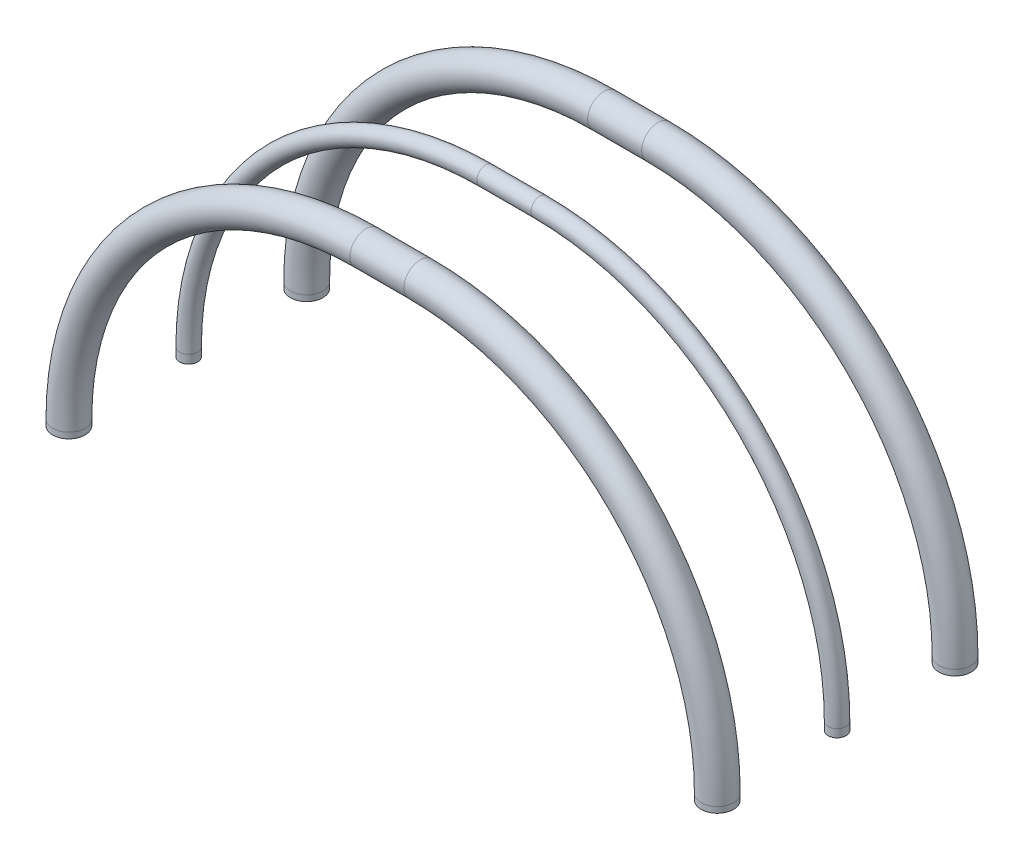
ISO-10303-21;
HEADER;
FILE_DESCRIPTION(('STEP AP214'),'2;1');
FILE_NAME('part.step','',(''),(''),'','','');
FILE_SCHEMA(('AUTOMOTIVE_DESIGN { 1 0 10303 214 1 1 1 1 }'));
ENDSEC;
DATA;
#1=APPLICATION_CONTEXT('core data for automotive mechanical design processes');
#2=APPLICATION_PROTOCOL_DEFINITION('international standard','automotive_design',2000,#1);
#3=PRODUCT_CONTEXT('',#1,'mechanical');
#4=PRODUCT('Part','Part','',(#3));
#5=PRODUCT_RELATED_PRODUCT_CATEGORY('part','',(#4));
#6=PRODUCT_DEFINITION_FORMATION('','',#4);
#7=PRODUCT_DEFINITION_CONTEXT('part definition',#1,'design');
#8=PRODUCT_DEFINITION('design','',#6,#7);
#9=PRODUCT_DEFINITION_SHAPE('','',#8);
#10=(LENGTH_UNIT() NAMED_UNIT(*) SI_UNIT(.MILLI.,.METRE.));
#11=(NAMED_UNIT(*) PLANE_ANGLE_UNIT() SI_UNIT($,.RADIAN.));
#12=(NAMED_UNIT(*) SI_UNIT($,.STERADIAN.) SOLID_ANGLE_UNIT());
#13=UNCERTAINTY_MEASURE_WITH_UNIT(LENGTH_MEASURE(1.E-05),#10,'distance_accuracy_value','');
#14=(GEOMETRIC_REPRESENTATION_CONTEXT(3) GLOBAL_UNCERTAINTY_ASSIGNED_CONTEXT((#13)) GLOBAL_UNIT_ASSIGNED_CONTEXT((#10,
#11,#12)) REPRESENTATION_CONTEXT('',''));
#15=CARTESIAN_POINT('',(0.,0.,0.));
#16=DIRECTION('',(0.,0.,1.));
#17=DIRECTION('',(1.,0.,0.));
#18=AXIS2_PLACEMENT_3D('',#15,#16,#17);
#19=CARTESIAN_POINT('',(-21649.9813405343,11704.6063194342,40541.3784980753));
#20=DIRECTION('',(0.,1.,0.));
#21=DIRECTION('',(0.,0.,1.));
#22=AXIS2_PLACEMENT_3D('',#19,#20,#21);
#23=PLANE('',#22);
#24=CARTESIAN_POINT('',(-21649.9813405343,11704.6063194342,40541.3784980753));
#25=DIRECTION('',(0.,1.,0.));
#26=DIRECTION('',(0.,0.,1.));
#27=AXIS2_PLACEMENT_3D('',#24,#25,#26);
#28=CIRCLE('',#27,15.7000000000002);
#29=CARTESIAN_POINT('',(-21649.9813405343,11704.6063194342,40557.0784980753));
#30=VERTEX_POINT('',#29);
#31=EDGE_CURVE('E97',#30,#30,#28,.T.);
#32=ORIENTED_EDGE('',*,*,#31,.T.);
#33=EDGE_LOOP('',(#32));
#34=FACE_BOUND('',#33,.T.);
#35=CARTESIAN_POINT('',(-21649.9813405343,11704.6063194342,40541.3784980753));
#36=DIRECTION('',(0.,1.,0.));
#37=DIRECTION('',(0.,0.,1.));
#38=AXIS2_PLACEMENT_3D('',#35,#36,#37);
#39=CIRCLE('',#38,16.7000000000002);
#40=CARTESIAN_POINT('',(-21649.9813405343,11704.6063194342,40558.0784980753));
#41=VERTEX_POINT('',#40);
#42=EDGE_CURVE('E90',#41,#41,#39,.T.);
#43=ORIENTED_EDGE('',*,*,#42,.F.);
#44=EDGE_LOOP('',(#43));
#45=FACE_BOUND('',#44,.T.);
#46=ADVANCED_FACE('F68',(#34,#45),#23,.F.);
#47=CARTESIAN_POINT('',(-22849.9813405343,11703.5487893793,40541.3784980753));
#48=DIRECTION('',(0.,-1.,0.));
#49=DIRECTION('',(0.,0.,1.));
#50=AXIS2_PLACEMENT_3D('',#47,#48,#49);
#51=PLANE('',#50);
#52=CARTESIAN_POINT('',(-22849.9813405343,11703.5487893793,40541.3784980753));
#53=DIRECTION('',(0.,-1.,0.));
#54=DIRECTION('',(0.,0.,-1.));
#55=AXIS2_PLACEMENT_3D('',#52,#53,#54);
#56=CIRCLE('',#55,15.7000000000002);
#57=CARTESIAN_POINT('',(-22849.9813405343,11703.5487893793,40525.6784980753));
#58=VERTEX_POINT('',#57);
#59=EDGE_CURVE('E93',#58,#58,#56,.T.);
#60=ORIENTED_EDGE('',*,*,#59,.F.);
#61=EDGE_LOOP('',(#60));
#62=FACE_BOUND('',#61,.T.);
#63=CARTESIAN_POINT('',(-22849.9813405343,11703.5487893793,40541.3784980753));
#64=DIRECTION('',(0.,-1.,0.));
#65=DIRECTION('',(0.,0.,1.));
#66=AXIS2_PLACEMENT_3D('',#63,#64,#65);
#67=CIRCLE('',#66,16.7000000000002);
#68=CARTESIAN_POINT('',(-22849.9813405343,11703.5487893793,40558.0784980753));
#69=VERTEX_POINT('',#68);
#70=EDGE_CURVE('E12',#69,#69,#67,.T.);
#71=ORIENTED_EDGE('',*,*,#70,.T.);
#72=EDGE_LOOP('',(#71));
#73=FACE_BOUND('',#72,.T.);
#74=ADVANCED_FACE('F140',(#62,#73),#51,.T.);
#75=CARTESIAN_POINT('',(-21649.9813405343,11704.6063194342,40541.3784980753));
#76=DIRECTION('',(0.,1.,0.));
#77=DIRECTION('',(0.,0.,1.));
#78=AXIS2_PLACEMENT_3D('',#75,#76,#77);
#79=CYLINDRICAL_SURFACE('',#78,16.7000000000002);
#80=CARTESIAN_POINT('',(-21649.9813405343,11719.3941812898,40541.3784980753));
#81=DIRECTION('',(0.,1.,0.));
#82=DIRECTION('',(0.,0.,1.));
#83=AXIS2_PLACEMENT_3D('',#80,#81,#82);
#84=CIRCLE('',#83,16.7000000000002);
#85=CARTESIAN_POINT('',(-21633.2813405342,11719.3941812898,40541.3784980753));
#86=VERTEX_POINT('',#85);
#87=EDGE_CURVE('E87',#86,#86,#84,.T.);
#88=ORIENTED_EDGE('',*,*,#87,.F.);
#89=EDGE_LOOP('',(#88));
#90=FACE_BOUND('',#89,.T.);
#91=ORIENTED_EDGE('',*,*,#42,.T.);
#92=EDGE_LOOP('',(#91));
#93=FACE_BOUND('',#92,.T.);
#94=ADVANCED_FACE('F142',(#90,#93),#79,.T.);
#95=CARTESIAN_POINT('',(-22199.9813405343,11719.3941812898,40541.3784980753));
#96=DIRECTION('',(0.,0.,1.));
#97=DIRECTION('',(1.,0.,0.));
#98=AXIS2_PLACEMENT_3D('',#95,#96,#97);
#99=TOROIDAL_SURFACE('',#98,550.00000000004,16.7000000000002);
#100=CARTESIAN_POINT('',(-22199.9813405343,12269.3941812898,40541.3784980753));
#101=DIRECTION('',(-1.,0.,0.));
#102=DIRECTION('',(0.,0.,1.));
#103=AXIS2_PLACEMENT_3D('',#100,#101,#102);
#104=CIRCLE('',#103,16.7000000000002);
#105=CARTESIAN_POINT('',(-22199.9813405343,12286.0941812898,40541.3784980753));
#106=VERTEX_POINT('',#105);
#107=EDGE_CURVE('E82',#106,#106,#104,.T.);
#108=CARTESIAN_POINT('',(-22199.9813405343,11719.3941812898,40541.3784980753));
#109=DIRECTION('',(0.,0.,1.));
#110=DIRECTION('',(1.,0.,0.));
#111=AXIS2_PLACEMENT_3D('',#108,#109,#110);
#112=CIRCLE('',#111,566.70000000004);
#113=EDGE_CURVE('',#86,#106,#112,.T.);
#114=ORIENTED_EDGE('',*,*,#87,.T.);
#115=ORIENTED_EDGE('',*,*,#107,.F.);
#116=ORIENTED_EDGE('',*,*,#113,.T.);
#117=ORIENTED_EDGE('',*,*,#113,.F.);
#118=EDGE_LOOP('',(#114,#116,#115,#117));
#119=FACE_BOUND('',#118,.T.);
#120=ADVANCED_FACE('F148',(#119),#99,.T.);
#121=CARTESIAN_POINT('',(-22199.9813405343,12269.3941812898,40541.3784980753));
#122=DIRECTION('',(-1.,0.,0.));
#123=DIRECTION('',(0.,0.,1.));
#124=AXIS2_PLACEMENT_3D('',#121,#122,#123);
#125=CYLINDRICAL_SURFACE('',#124,16.7000000000002);
#126=CARTESIAN_POINT('',(-22299.9813405343,12269.3941812898,40541.3784980753));
#127=DIRECTION('',(-1.,0.,0.));
#128=DIRECTION('',(0.,0.,1.));
#129=AXIS2_PLACEMENT_3D('',#126,#127,#128);
#130=CIRCLE('',#129,16.7000000000002);
#131=CARTESIAN_POINT('',(-22299.9813405343,12286.0941812898,40541.3784980753));
#132=VERTEX_POINT('',#131);
#133=EDGE_CURVE('E78',#132,#132,#130,.T.);
#134=ORIENTED_EDGE('',*,*,#133,.F.);
#135=EDGE_LOOP('',(#134));
#136=FACE_BOUND('',#135,.T.);
#137=ORIENTED_EDGE('',*,*,#107,.T.);
#138=EDGE_LOOP('',(#137));
#139=FACE_BOUND('',#138,.T.);
#140=ADVANCED_FACE('F136',(#136,#139),#125,.T.);
#141=CARTESIAN_POINT('',(-22299.9813405343,11719.3941812898,40541.3784980753));
#142=DIRECTION('',(0.,0.,1.));
#143=DIRECTION('',(1.,0.,0.));
#144=AXIS2_PLACEMENT_3D('',#141,#142,#143);
#145=TOROIDAL_SURFACE('',#144,549.999999999997,16.7000000000002);
#146=CARTESIAN_POINT('',(-22849.9813405343,11719.3941812898,40541.3784980753));
#147=DIRECTION('',(0.,-1.,0.));
#148=DIRECTION('',(0.,0.,1.));
#149=AXIS2_PLACEMENT_3D('',#146,#147,#148);
#150=CIRCLE('',#149,16.7000000000002);
#151=CARTESIAN_POINT('',(-22866.6813405343,11719.3941812898,40541.3784980753));
#152=VERTEX_POINT('',#151);
#153=EDGE_CURVE('E74',#152,#152,#150,.T.);
#154=CARTESIAN_POINT('',(-22299.9813405343,11719.3941812898,40541.3784980753));
#155=DIRECTION('',(0.,0.,1.));
#156=DIRECTION('',(1.,0.,0.));
#157=AXIS2_PLACEMENT_3D('',#154,#155,#156);
#158=CIRCLE('',#157,566.699999999997);
#159=EDGE_CURVE('',#132,#152,#158,.T.);
#160=ORIENTED_EDGE('',*,*,#133,.T.);
#161=ORIENTED_EDGE('',*,*,#153,.F.);
#162=ORIENTED_EDGE('',*,*,#159,.T.);
#163=ORIENTED_EDGE('',*,*,#159,.F.);
#164=EDGE_LOOP('',(#160,#162,#161,#163));
#165=FACE_BOUND('',#164,.T.);
#166=ADVANCED_FACE('F130',(#165),#145,.T.);
#167=CARTESIAN_POINT('',(-22849.9813405343,11719.3941812898,40541.3784980753));
#168=DIRECTION('',(0.,-1.,0.));
#169=DIRECTION('',(0.,0.,-1.));
#170=AXIS2_PLACEMENT_3D('',#167,#168,#169);
#171=CYLINDRICAL_SURFACE('',#170,16.7000000000002);
#172=ORIENTED_EDGE('',*,*,#70,.F.);
#173=EDGE_LOOP('',(#172));
#174=FACE_BOUND('',#173,.T.);
#175=ORIENTED_EDGE('',*,*,#153,.T.);
#176=EDGE_LOOP('',(#175));
#177=FACE_BOUND('',#176,.T.);
#178=ADVANCED_FACE('F127',(#174,#177),#171,.T.);
#179=CARTESIAN_POINT('',(-21649.9813405343,11704.6063194342,40541.3784980753));
#180=DIRECTION('',(0.,1.,0.));
#181=DIRECTION('',(0.,0.,1.));
#182=AXIS2_PLACEMENT_3D('',#179,#180,#181);
#183=CYLINDRICAL_SURFACE('',#182,15.7000000000002);
#184=CARTESIAN_POINT('',(-21649.9813405342,11719.3941812898,40541.3784980753));
#185=DIRECTION('',(0.,-1.,0.));
#186=DIRECTION('',(1.,0.,0.));
#187=AXIS2_PLACEMENT_3D('',#184,#185,#186);
#188=CIRCLE('',#187,15.7000000000002);
#189=CARTESIAN_POINT('',(-21634.2813405342,11719.3941812898,40541.3784980753));
#190=VERTEX_POINT('',#189);
#191=EDGE_CURVE('E100',#190,#190,#188,.F.);
#192=ORIENTED_EDGE('',*,*,#191,.T.);
#193=EDGE_LOOP('',(#192));
#194=FACE_BOUND('',#193,.T.);
#195=ORIENTED_EDGE('',*,*,#31,.F.);
#196=EDGE_LOOP('',(#195));
#197=FACE_BOUND('',#196,.T.);
#198=ADVANCED_FACE('F112',(#194,#197),#183,.F.);
#199=CARTESIAN_POINT('',(-22199.9813405343,11719.3941812898,40541.3784980753));
#200=DIRECTION('',(0.,0.,1.));
#201=DIRECTION('',(1.,0.,0.));
#202=AXIS2_PLACEMENT_3D('',#199,#200,#201);
#203=TOROIDAL_SURFACE('',#202,550.00000000004,15.7000000000002);
#204=CARTESIAN_POINT('',(-22199.9813405343,12269.3941812898,40541.3784980753));
#205=DIRECTION('',(-1.,0.,0.));
#206=DIRECTION('',(0.,0.,1.));
#207=AXIS2_PLACEMENT_3D('',#204,#205,#206);
#208=CIRCLE('',#207,15.7000000000002);
#209=CARTESIAN_POINT('',(-22199.9813405343,12285.0941812898,40541.3784980753));
#210=VERTEX_POINT('',#209);
#211=EDGE_CURVE('E106',#210,#210,#208,.T.);
#212=CARTESIAN_POINT('',(-22199.9813405343,11719.3941812898,40541.3784980753));
#213=DIRECTION('',(0.,0.,1.));
#214=DIRECTION('',(1.,0.,0.));
#215=AXIS2_PLACEMENT_3D('',#212,#213,#214);
#216=CIRCLE('',#215,565.70000000004);
#217=EDGE_CURVE('',#190,#210,#216,.T.);
#218=ORIENTED_EDGE('',*,*,#191,.F.);
#219=ORIENTED_EDGE('',*,*,#211,.T.);
#220=ORIENTED_EDGE('',*,*,#217,.T.);
#221=ORIENTED_EDGE('',*,*,#217,.F.);
#222=EDGE_LOOP('',(#218,#220,#219,#221));
#223=FACE_BOUND('',#222,.T.);
#224=ADVANCED_FACE('F115',(#223),#203,.F.);
#225=CARTESIAN_POINT('',(-22199.9813405343,12269.3941812898,40541.3784980753));
#226=DIRECTION('',(-1.,0.,0.));
#227=DIRECTION('',(0.,0.,1.));
#228=AXIS2_PLACEMENT_3D('',#225,#226,#227);
#229=CYLINDRICAL_SURFACE('',#228,15.7000000000002);
#230=CARTESIAN_POINT('',(-22299.9813405343,12269.3941812898,40541.3784980753));
#231=DIRECTION('',(1.,0.,0.));
#232=DIRECTION('',(0.,1.,0.));
#233=AXIS2_PLACEMENT_3D('',#230,#231,#232);
#234=CIRCLE('',#233,15.7000000000002);
#235=CARTESIAN_POINT('',(-22299.9813405343,12285.0941812898,40541.3784980753));
#236=VERTEX_POINT('',#235);
#237=EDGE_CURVE('E103',#236,#236,#234,.F.);
#238=ORIENTED_EDGE('',*,*,#237,.T.);
#239=EDGE_LOOP('',(#238));
#240=FACE_BOUND('',#239,.T.);
#241=ORIENTED_EDGE('',*,*,#211,.F.);
#242=EDGE_LOOP('',(#241));
#243=FACE_BOUND('',#242,.T.);
#244=ADVANCED_FACE('F117',(#240,#243),#229,.F.);
#245=CARTESIAN_POINT('',(-22299.9813405343,11719.3941812898,40541.3784980753));
#246=DIRECTION('',(0.,0.,1.));
#247=DIRECTION('',(1.,0.,0.));
#248=AXIS2_PLACEMENT_3D('',#245,#246,#247);
#249=TOROIDAL_SURFACE('',#248,549.999999999997,15.7000000000002);
#250=CARTESIAN_POINT('',(-22849.9813405343,11719.3941812898,40541.3784980753));
#251=DIRECTION('',(0.,-1.,0.));
#252=DIRECTION('',(0.,0.,-1.));
#253=AXIS2_PLACEMENT_3D('',#250,#251,#252);
#254=CIRCLE('',#253,15.7000000000002);
#255=CARTESIAN_POINT('',(-22865.6813405342,11719.3941812898,40541.3784980753));
#256=VERTEX_POINT('',#255);
#257=EDGE_CURVE('E96',#256,#256,#254,.T.);
#258=CARTESIAN_POINT('',(-22299.9813405343,11719.3941812898,40541.3784980753));
#259=DIRECTION('',(0.,0.,1.));
#260=DIRECTION('',(1.,0.,0.));
#261=AXIS2_PLACEMENT_3D('',#258,#259,#260);
#262=CIRCLE('',#261,565.699999999997);
#263=EDGE_CURVE('',#236,#256,#262,.T.);
#264=ORIENTED_EDGE('',*,*,#237,.F.);
#265=ORIENTED_EDGE('',*,*,#257,.T.);
#266=ORIENTED_EDGE('',*,*,#263,.T.);
#267=ORIENTED_EDGE('',*,*,#263,.F.);
#268=EDGE_LOOP('',(#264,#266,#265,#267));
#269=FACE_BOUND('',#268,.T.);
#270=ADVANCED_FACE('F124',(#269),#249,.F.);
#271=CARTESIAN_POINT('',(-22849.9813405343,11719.3941812898,40541.3784980753));
#272=DIRECTION('',(0.,-1.,0.));
#273=DIRECTION('',(0.,0.,-1.));
#274=AXIS2_PLACEMENT_3D('',#271,#272,#273);
#275=CYLINDRICAL_SURFACE('',#274,15.7000000000002);
#276=ORIENTED_EDGE('',*,*,#59,.T.);
#277=EDGE_LOOP('',(#276));
#278=FACE_BOUND('',#277,.T.);
#279=ORIENTED_EDGE('',*,*,#257,.F.);
#280=EDGE_LOOP('',(#279));
#281=FACE_BOUND('',#280,.T.);
#282=ADVANCED_FACE('F152',(#278,#281),#275,.F.);
#283=CLOSED_SHELL('',(#46,#74,#94,#120,#140,#166,#178,#198,#224,#244,#270,#282));
#284=MANIFOLD_SOLID_BREP('B2',#283);
#285=CARTESIAN_POINT('',(-22850.481156353,11703.4506207878,40322.4958478472));
#286=DIRECTION('',(0.,1.,0.));
#287=DIRECTION('',(0.,0.,1.));
#288=AXIS2_PLACEMENT_3D('',#285,#286,#287);
#289=PLANE('',#288);
#290=CARTESIAN_POINT('',(-22850.481156353,11703.4506207878,40322.4958478472));
#291=DIRECTION('',(0.,1.,0.));
#292=DIRECTION('',(0.,0.,1.));
#293=AXIS2_PLACEMENT_3D('',#290,#291,#292);
#294=CIRCLE('',#293,29.0000000000011);
#295=CARTESIAN_POINT('',(-22850.481156353,11703.4506207878,40351.4958478472));
#296=VERTEX_POINT('',#295);
#297=EDGE_CURVE('E310',#296,#296,#294,.T.);
#298=ORIENTED_EDGE('',*,*,#297,.T.);
#299=EDGE_LOOP('',(#298));
#300=FACE_BOUND('',#299,.T.);
#301=CARTESIAN_POINT('',(-22850.481156353,11703.4506207878,40322.4958478472));
#302=DIRECTION('',(0.,1.,0.));
#303=DIRECTION('',(0.,0.,1.));
#304=AXIS2_PLACEMENT_3D('',#301,#302,#303);
#305=CIRCLE('',#304,30.0000000000011);
#306=CARTESIAN_POINT('',(-22850.481156353,11703.4506207878,40352.4958478472));
#307=VERTEX_POINT('',#306);
#308=EDGE_CURVE('E303',#307,#307,#305,.T.);
#309=ORIENTED_EDGE('',*,*,#308,.F.);
#310=EDGE_LOOP('',(#309));
#311=FACE_BOUND('',#310,.T.);
#312=ADVANCED_FACE('F281',(#300,#311),#289,.F.);
#313=CARTESIAN_POINT('',(-21650.481156353,11703.4506207878,40322.4958478472));
#314=DIRECTION('',(0.,-1.,0.));
#315=DIRECTION('',(0.,0.,1.));
#316=AXIS2_PLACEMENT_3D('',#313,#314,#315);
#317=PLANE('',#316);
#318=CARTESIAN_POINT('',(-21650.481156353,11703.4506207878,40322.4958478472));
#319=DIRECTION('',(0.,-1.,0.));
#320=DIRECTION('',(0.,0.,-1.));
#321=AXIS2_PLACEMENT_3D('',#318,#319,#320);
#322=CIRCLE('',#321,29.0000000000011);
#323=CARTESIAN_POINT('',(-21650.481156353,11703.4506207878,40293.4958478472));
#324=VERTEX_POINT('',#323);
#325=EDGE_CURVE('E306',#324,#324,#322,.T.);
#326=ORIENTED_EDGE('',*,*,#325,.F.);
#327=EDGE_LOOP('',(#326));
#328=FACE_BOUND('',#327,.T.);
#329=CARTESIAN_POINT('',(-21650.481156353,11703.4506207878,40322.4958478472));
#330=DIRECTION('',(0.,-1.,0.));
#331=DIRECTION('',(0.,0.,1.));
#332=AXIS2_PLACEMENT_3D('',#329,#330,#331);
#333=CIRCLE('',#332,30.0000000000011);
#334=CARTESIAN_POINT('',(-21650.481156353,11703.4506207878,40352.4958478472));
#335=VERTEX_POINT('',#334);
#336=EDGE_CURVE('E67',#335,#335,#333,.T.);
#337=ORIENTED_EDGE('',*,*,#336,.T.);
#338=EDGE_LOOP('',(#337));
#339=FACE_BOUND('',#338,.T.);
#340=ADVANCED_FACE('F353',(#328,#339),#317,.T.);
#341=CARTESIAN_POINT('',(-22850.481156353,11703.4506207878,40322.4958478472));
#342=DIRECTION('',(0.,1.,0.));
#343=DIRECTION('',(0.,0.,1.));
#344=AXIS2_PLACEMENT_3D('',#341,#342,#343);
#345=CYLINDRICAL_SURFACE('',#344,30.0000000000011);
#346=CARTESIAN_POINT('',(-22850.481156353,11714.2234820204,40322.4958478472));
#347=DIRECTION('',(0.,1.,0.));
#348=DIRECTION('',(0.,0.,1.));
#349=AXIS2_PLACEMENT_3D('',#346,#347,#348);
#350=CIRCLE('',#349,30.0000000000011);
#351=CARTESIAN_POINT('',(-22880.481156353,11714.2234820204,40322.4958478472));
#352=VERTEX_POINT('',#351);
#353=EDGE_CURVE('E300',#352,#352,#350,.T.);
#354=ORIENTED_EDGE('',*,*,#353,.F.);
#355=EDGE_LOOP('',(#354));
#356=FACE_BOUND('',#355,.T.);
#357=ORIENTED_EDGE('',*,*,#308,.T.);
#358=EDGE_LOOP('',(#357));
#359=FACE_BOUND('',#358,.T.);
#360=ADVANCED_FACE('F355',(#356,#359),#345,.T.);
#361=CARTESIAN_POINT('',(-22300.481156353,11714.2234820204,40322.4958478472));
#362=DIRECTION('',(0.,0.,-1.));
#363=DIRECTION('',(-1.,0.,0.));
#364=AXIS2_PLACEMENT_3D('',#361,#362,#363);
#365=TOROIDAL_SURFACE('',#364,550.00000000004,30.0000000000011);
#366=CARTESIAN_POINT('',(-22300.481156353,12264.2234820204,40322.4958478472));
#367=DIRECTION('',(1.,0.,0.));
#368=DIRECTION('',(0.,0.,1.));
#369=AXIS2_PLACEMENT_3D('',#366,#367,#368);
#370=CIRCLE('',#369,30.0000000000011);
#371=CARTESIAN_POINT('',(-22300.481156353,12294.2234820204,40322.4958478472));
#372=VERTEX_POINT('',#371);
#373=EDGE_CURVE('E295',#372,#372,#370,.T.);
#374=CARTESIAN_POINT('',(-22300.481156353,11714.2234820204,40322.4958478472));
#375=DIRECTION('',(0.,0.,-1.));
#376=DIRECTION('',(-1.,0.,0.));
#377=AXIS2_PLACEMENT_3D('',#374,#375,#376);
#378=CIRCLE('',#377,580.000000000041);
#379=EDGE_CURVE('',#352,#372,#378,.T.);
#380=ORIENTED_EDGE('',*,*,#353,.T.);
#381=ORIENTED_EDGE('',*,*,#373,.F.);
#382=ORIENTED_EDGE('',*,*,#379,.T.);
#383=ORIENTED_EDGE('',*,*,#379,.F.);
#384=EDGE_LOOP('',(#380,#382,#381,#383));
#385=FACE_BOUND('',#384,.T.);
#386=ADVANCED_FACE('F361',(#385),#365,.T.);
#387=CARTESIAN_POINT('',(-22300.481156353,12264.2234820204,40322.4958478472));
#388=DIRECTION('',(1.,0.,0.));
#389=DIRECTION('',(0.,0.,-1.));
#390=AXIS2_PLACEMENT_3D('',#387,#388,#389);
#391=CYLINDRICAL_SURFACE('',#390,30.0000000000011);
#392=CARTESIAN_POINT('',(-22200.481156353,12264.2234820204,40322.4958478472));
#393=DIRECTION('',(1.,0.,0.));
#394=DIRECTION('',(0.,0.,1.));
#395=AXIS2_PLACEMENT_3D('',#392,#393,#394);
#396=CIRCLE('',#395,30.0000000000011);
#397=CARTESIAN_POINT('',(-22200.481156353,12294.2234820204,40322.4958478472));
#398=VERTEX_POINT('',#397);
#399=EDGE_CURVE('E291',#398,#398,#396,.T.);
#400=ORIENTED_EDGE('',*,*,#399,.F.);
#401=EDGE_LOOP('',(#400));
#402=FACE_BOUND('',#401,.T.);
#403=ORIENTED_EDGE('',*,*,#373,.T.);
#404=EDGE_LOOP('',(#403));
#405=FACE_BOUND('',#404,.T.);
#406=ADVANCED_FACE('F349',(#402,#405),#391,.T.);
#407=CARTESIAN_POINT('',(-22200.481156353,11714.2234820204,40322.4958478472));
#408=DIRECTION('',(0.,0.,-1.));
#409=DIRECTION('',(-1.,0.,0.));
#410=AXIS2_PLACEMENT_3D('',#407,#408,#409);
#411=TOROIDAL_SURFACE('',#410,550.000000000001,30.0000000000011);
#412=CARTESIAN_POINT('',(-21650.481156353,11714.2234820204,40322.4958478472));
#413=DIRECTION('',(0.,-1.,0.));
#414=DIRECTION('',(0.,0.,1.));
#415=AXIS2_PLACEMENT_3D('',#412,#413,#414);
#416=CIRCLE('',#415,30.0000000000011);
#417=CARTESIAN_POINT('',(-21620.481156353,11714.2234820204,40322.4958478472));
#418=VERTEX_POINT('',#417);
#419=EDGE_CURVE('E287',#418,#418,#416,.T.);
#420=CARTESIAN_POINT('',(-22200.481156353,11714.2234820204,40322.4958478472));
#421=DIRECTION('',(0.,0.,-1.));
#422=DIRECTION('',(-1.,0.,0.));
#423=AXIS2_PLACEMENT_3D('',#420,#421,#422);
#424=CIRCLE('',#423,580.000000000002);
#425=EDGE_CURVE('',#398,#418,#424,.T.);
#426=ORIENTED_EDGE('',*,*,#399,.T.);
#427=ORIENTED_EDGE('',*,*,#419,.F.);
#428=ORIENTED_EDGE('',*,*,#425,.T.);
#429=ORIENTED_EDGE('',*,*,#425,.F.);
#430=EDGE_LOOP('',(#426,#428,#427,#429));
#431=FACE_BOUND('',#430,.T.);
#432=ADVANCED_FACE('F343',(#431),#411,.T.);
#433=CARTESIAN_POINT('',(-21650.481156353,11714.2234820204,40322.4958478472));
#434=DIRECTION('',(0.,-1.,0.));
#435=DIRECTION('',(0.,0.,-1.));
#436=AXIS2_PLACEMENT_3D('',#433,#434,#435);
#437=CYLINDRICAL_SURFACE('',#436,30.0000000000011);
#438=ORIENTED_EDGE('',*,*,#336,.F.);
#439=EDGE_LOOP('',(#438));
#440=FACE_BOUND('',#439,.T.);
#441=ORIENTED_EDGE('',*,*,#419,.T.);
#442=EDGE_LOOP('',(#441));
#443=FACE_BOUND('',#442,.T.);
#444=ADVANCED_FACE('F340',(#440,#443),#437,.T.);
#445=CARTESIAN_POINT('',(-22850.481156353,11703.4506207878,40322.4958478472));
#446=DIRECTION('',(0.,1.,0.));
#447=DIRECTION('',(0.,0.,1.));
#448=AXIS2_PLACEMENT_3D('',#445,#446,#447);
#449=CYLINDRICAL_SURFACE('',#448,29.0000000000011);
#450=CARTESIAN_POINT('',(-22850.481156353,11714.2234820204,40322.4958478472));
#451=DIRECTION('',(0.,-1.,0.));
#452=DIRECTION('',(1.,0.,0.));
#453=AXIS2_PLACEMENT_3D('',#450,#451,#452);
#454=CIRCLE('',#453,29.0000000000011);
#455=CARTESIAN_POINT('',(-22879.481156353,11714.2234820204,40322.4958478472));
#456=VERTEX_POINT('',#455);
#457=EDGE_CURVE('E313',#456,#456,#454,.F.);
#458=ORIENTED_EDGE('',*,*,#457,.T.);
#459=EDGE_LOOP('',(#458));
#460=FACE_BOUND('',#459,.T.);
#461=ORIENTED_EDGE('',*,*,#297,.F.);
#462=EDGE_LOOP('',(#461));
#463=FACE_BOUND('',#462,.T.);
#464=ADVANCED_FACE('F325',(#460,#463),#449,.F.);
#465=CARTESIAN_POINT('',(-22300.481156353,11714.2234820204,40322.4958478472));
#466=DIRECTION('',(0.,0.,-1.));
#467=DIRECTION('',(-1.,0.,0.));
#468=AXIS2_PLACEMENT_3D('',#465,#466,#467);
#469=TOROIDAL_SURFACE('',#468,550.00000000004,29.0000000000011);
#470=CARTESIAN_POINT('',(-22300.481156353,12264.2234820204,40322.4958478472));
#471=DIRECTION('',(1.,0.,0.));
#472=DIRECTION('',(0.,0.,-1.));
#473=AXIS2_PLACEMENT_3D('',#470,#471,#472);
#474=CIRCLE('',#473,29.0000000000011);
#475=CARTESIAN_POINT('',(-22300.481156353,12293.2234820204,40322.4958478472));
#476=VERTEX_POINT('',#475);
#477=EDGE_CURVE('E319',#476,#476,#474,.T.);
#478=CARTESIAN_POINT('',(-22300.481156353,11714.2234820204,40322.4958478472));
#479=DIRECTION('',(0.,0.,-1.));
#480=DIRECTION('',(-1.,0.,0.));
#481=AXIS2_PLACEMENT_3D('',#478,#479,#480);
#482=CIRCLE('',#481,579.000000000041);
#483=EDGE_CURVE('',#456,#476,#482,.T.);
#484=ORIENTED_EDGE('',*,*,#457,.F.);
#485=ORIENTED_EDGE('',*,*,#477,.T.);
#486=ORIENTED_EDGE('',*,*,#483,.T.);
#487=ORIENTED_EDGE('',*,*,#483,.F.);
#488=EDGE_LOOP('',(#484,#486,#485,#487));
#489=FACE_BOUND('',#488,.T.);
#490=ADVANCED_FACE('F328',(#489),#469,.F.);
#491=CARTESIAN_POINT('',(-22300.481156353,12264.2234820204,40322.4958478472));
#492=DIRECTION('',(1.,0.,0.));
#493=DIRECTION('',(0.,0.,-1.));
#494=AXIS2_PLACEMENT_3D('',#491,#492,#493);
#495=CYLINDRICAL_SURFACE('',#494,29.0000000000011);
#496=CARTESIAN_POINT('',(-22200.481156353,12264.2234820204,40322.4958478472));
#497=DIRECTION('',(-1.,0.,0.));
#498=DIRECTION('',(0.,-1.,0.));
#499=AXIS2_PLACEMENT_3D('',#496,#497,#498);
#500=CIRCLE('',#499,29.0000000000011);
#501=CARTESIAN_POINT('',(-22200.481156353,12293.2234820204,40322.4958478472));
#502=VERTEX_POINT('',#501);
#503=EDGE_CURVE('E316',#502,#502,#500,.F.);
#504=ORIENTED_EDGE('',*,*,#503,.T.);
#505=EDGE_LOOP('',(#504));
#506=FACE_BOUND('',#505,.T.);
#507=ORIENTED_EDGE('',*,*,#477,.F.);
#508=EDGE_LOOP('',(#507));
#509=FACE_BOUND('',#508,.T.);
#510=ADVANCED_FACE('F330',(#506,#509),#495,.F.);
#511=CARTESIAN_POINT('',(-22200.481156353,11714.2234820204,40322.4958478472));
#512=DIRECTION('',(0.,0.,-1.));
#513=DIRECTION('',(-1.,0.,0.));
#514=AXIS2_PLACEMENT_3D('',#511,#512,#513);
#515=TOROIDAL_SURFACE('',#514,550.000000000001,29.0000000000011);
#516=CARTESIAN_POINT('',(-21650.481156353,11714.2234820204,40322.4958478472));
#517=DIRECTION('',(0.,-1.,0.));
#518=DIRECTION('',(0.,0.,-1.));
#519=AXIS2_PLACEMENT_3D('',#516,#517,#518);
#520=CIRCLE('',#519,29.0000000000011);
#521=CARTESIAN_POINT('',(-21621.481156353,11714.2234820204,40322.4958478472));
#522=VERTEX_POINT('',#521);
#523=EDGE_CURVE('E309',#522,#522,#520,.T.);
#524=CARTESIAN_POINT('',(-22200.481156353,11714.2234820204,40322.4958478472));
#525=DIRECTION('',(0.,0.,-1.));
#526=DIRECTION('',(-1.,0.,0.));
#527=AXIS2_PLACEMENT_3D('',#524,#525,#526);
#528=CIRCLE('',#527,579.000000000002);
#529=EDGE_CURVE('',#502,#522,#528,.T.);
#530=ORIENTED_EDGE('',*,*,#503,.F.);
#531=ORIENTED_EDGE('',*,*,#523,.T.);
#532=ORIENTED_EDGE('',*,*,#529,.T.);
#533=ORIENTED_EDGE('',*,*,#529,.F.);
#534=EDGE_LOOP('',(#530,#532,#531,#533));
#535=FACE_BOUND('',#534,.T.);
#536=ADVANCED_FACE('F337',(#535),#515,.F.);
#537=CARTESIAN_POINT('',(-21650.481156353,11714.2234820204,40322.4958478472));
#538=DIRECTION('',(0.,-1.,0.));
#539=DIRECTION('',(0.,0.,-1.));
#540=AXIS2_PLACEMENT_3D('',#537,#538,#539);
#541=CYLINDRICAL_SURFACE('',#540,29.0000000000011);
#542=ORIENTED_EDGE('',*,*,#325,.T.);
#543=EDGE_LOOP('',(#542));
#544=FACE_BOUND('',#543,.T.);
#545=ORIENTED_EDGE('',*,*,#523,.F.);
#546=EDGE_LOOP('',(#545));
#547=FACE_BOUND('',#546,.T.);
#548=ADVANCED_FACE('F365',(#544,#547),#541,.F.);
#549=CLOSED_SHELL('',(#312,#340,#360,#386,#406,#432,#444,#464,#490,#510,#536,#548));
#550=MANIFOLD_SOLID_BREP('B7',#549);
#551=CARTESIAN_POINT('',(-22850.481156353,11703.4506207878,40762.4958478472));
#552=DIRECTION('',(0.,1.,0.));
#553=DIRECTION('',(0.,0.,1.));
#554=AXIS2_PLACEMENT_3D('',#551,#552,#553);
#555=PLANE('',#554);
#556=CARTESIAN_POINT('',(-22850.481156353,11703.4506207878,40762.4958478472));
#557=DIRECTION('',(0.,1.,0.));
#558=DIRECTION('',(0.,0.,1.));
#559=AXIS2_PLACEMENT_3D('',#556,#557,#558);
#560=CIRCLE('',#559,29.0000000000011);
#561=CARTESIAN_POINT('',(-22850.481156353,11703.4506207878,40791.4958478472));
#562=VERTEX_POINT('',#561);
#563=EDGE_CURVE('E516',#562,#562,#560,.T.);
#564=ORIENTED_EDGE('',*,*,#563,.T.);
#565=EDGE_LOOP('',(#564));
#566=FACE_BOUND('',#565,.T.);
#567=CARTESIAN_POINT('',(-22850.481156353,11703.4506207878,40762.4958478472));
#568=DIRECTION('',(0.,1.,0.));
#569=DIRECTION('',(0.,0.,1.));
#570=AXIS2_PLACEMENT_3D('',#567,#568,#569);
#571=CIRCLE('',#570,30.0000000000011);
#572=CARTESIAN_POINT('',(-22850.481156353,11703.4506207878,40792.4958478472));
#573=VERTEX_POINT('',#572);
#574=EDGE_CURVE('E509',#573,#573,#571,.T.);
#575=ORIENTED_EDGE('',*,*,#574,.F.);
#576=EDGE_LOOP('',(#575));
#577=FACE_BOUND('',#576,.T.);
#578=ADVANCED_FACE('F487',(#566,#577),#555,.F.);
#579=CARTESIAN_POINT('',(-21650.481156353,11703.4506207878,40762.4958478472));
#580=DIRECTION('',(0.,-1.,0.));
#581=DIRECTION('',(0.,0.,1.));
#582=AXIS2_PLACEMENT_3D('',#579,#580,#581);
#583=PLANE('',#582);
#584=CARTESIAN_POINT('',(-21650.481156353,11703.4506207878,40762.4958478472));
#585=DIRECTION('',(0.,-1.,0.));
#586=DIRECTION('',(0.,0.,-1.));
#587=AXIS2_PLACEMENT_3D('',#584,#585,#586);
#588=CIRCLE('',#587,29.0000000000011);
#589=CARTESIAN_POINT('',(-21650.481156353,11703.4506207878,40733.4958478472));
#590=VERTEX_POINT('',#589);
#591=EDGE_CURVE('E512',#590,#590,#588,.T.);
#592=ORIENTED_EDGE('',*,*,#591,.F.);
#593=EDGE_LOOP('',(#592));
#594=FACE_BOUND('',#593,.T.);
#595=CARTESIAN_POINT('',(-21650.481156353,11703.4506207878,40762.4958478472));
#596=DIRECTION('',(0.,-1.,0.));
#597=DIRECTION('',(0.,0.,1.));
#598=AXIS2_PLACEMENT_3D('',#595,#596,#597);
#599=CIRCLE('',#598,30.0000000000011);
#600=CARTESIAN_POINT('',(-21650.481156353,11703.4506207878,40792.4958478472));
#601=VERTEX_POINT('',#600);
#602=EDGE_CURVE('E280',#601,#601,#599,.T.);
#603=ORIENTED_EDGE('',*,*,#602,.T.);
#604=EDGE_LOOP('',(#603));
#605=FACE_BOUND('',#604,.T.);
#606=ADVANCED_FACE('F559',(#594,#605),#583,.T.);
#607=CARTESIAN_POINT('',(-22850.481156353,11703.4506207878,40762.4958478472));
#608=DIRECTION('',(0.,1.,0.));
#609=DIRECTION('',(0.,0.,1.));
#610=AXIS2_PLACEMENT_3D('',#607,#608,#609);
#611=CYLINDRICAL_SURFACE('',#610,30.0000000000011);
#612=CARTESIAN_POINT('',(-22850.481156353,11714.2234820204,40762.4958478472));
#613=DIRECTION('',(0.,1.,0.));
#614=DIRECTION('',(0.,0.,1.));
#615=AXIS2_PLACEMENT_3D('',#612,#613,#614);
#616=CIRCLE('',#615,30.0000000000011);
#617=CARTESIAN_POINT('',(-22880.481156353,11714.2234820204,40762.4958478472));
#618=VERTEX_POINT('',#617);
#619=EDGE_CURVE('E506',#618,#618,#616,.T.);
#620=ORIENTED_EDGE('',*,*,#619,.F.);
#621=EDGE_LOOP('',(#620));
#622=FACE_BOUND('',#621,.T.);
#623=ORIENTED_EDGE('',*,*,#574,.T.);
#624=EDGE_LOOP('',(#623));
#625=FACE_BOUND('',#624,.T.);
#626=ADVANCED_FACE('F561',(#622,#625),#611,.T.);
#627=CARTESIAN_POINT('',(-22300.481156353,11714.2234820204,40762.4958478472));
#628=DIRECTION('',(0.,0.,-1.));
#629=DIRECTION('',(-1.,0.,0.));
#630=AXIS2_PLACEMENT_3D('',#627,#628,#629);
#631=TOROIDAL_SURFACE('',#630,550.00000000004,30.0000000000011);
#632=CARTESIAN_POINT('',(-22300.481156353,12264.2234820204,40762.4958478472));
#633=DIRECTION('',(1.,0.,0.));
#634=DIRECTION('',(0.,0.,1.));
#635=AXIS2_PLACEMENT_3D('',#632,#633,#634);
#636=CIRCLE('',#635,30.0000000000011);
#637=CARTESIAN_POINT('',(-22300.481156353,12294.2234820204,40762.4958478472));
#638=VERTEX_POINT('',#637);
#639=EDGE_CURVE('E501',#638,#638,#636,.T.);
#640=CARTESIAN_POINT('',(-22300.481156353,11714.2234820204,40762.4958478472));
#641=DIRECTION('',(0.,0.,-1.));
#642=DIRECTION('',(-1.,0.,0.));
#643=AXIS2_PLACEMENT_3D('',#640,#641,#642);
#644=CIRCLE('',#643,580.000000000041);
#645=EDGE_CURVE('',#618,#638,#644,.T.);
#646=ORIENTED_EDGE('',*,*,#619,.T.);
#647=ORIENTED_EDGE('',*,*,#639,.F.);
#648=ORIENTED_EDGE('',*,*,#645,.T.);
#649=ORIENTED_EDGE('',*,*,#645,.F.);
#650=EDGE_LOOP('',(#646,#648,#647,#649));
#651=FACE_BOUND('',#650,.T.);
#652=ADVANCED_FACE('F567',(#651),#631,.T.);
#653=CARTESIAN_POINT('',(-22300.481156353,12264.2234820204,40762.4958478472));
#654=DIRECTION('',(1.,0.,0.));
#655=DIRECTION('',(0.,0.,-1.));
#656=AXIS2_PLACEMENT_3D('',#653,#654,#655);
#657=CYLINDRICAL_SURFACE('',#656,30.0000000000011);
#658=CARTESIAN_POINT('',(-22200.481156353,12264.2234820204,40762.4958478472));
#659=DIRECTION('',(1.,0.,0.));
#660=DIRECTION('',(0.,0.,1.));
#661=AXIS2_PLACEMENT_3D('',#658,#659,#660);
#662=CIRCLE('',#661,30.0000000000011);
#663=CARTESIAN_POINT('',(-22200.481156353,12294.2234820204,40762.4958478472));
#664=VERTEX_POINT('',#663);
#665=EDGE_CURVE('E497',#664,#664,#662,.T.);
#666=ORIENTED_EDGE('',*,*,#665,.F.);
#667=EDGE_LOOP('',(#666));
#668=FACE_BOUND('',#667,.T.);
#669=ORIENTED_EDGE('',*,*,#639,.T.);
#670=EDGE_LOOP('',(#669));
#671=FACE_BOUND('',#670,.T.);
#672=ADVANCED_FACE('F555',(#668,#671),#657,.T.);
#673=CARTESIAN_POINT('',(-22200.481156353,11714.2234820204,40762.4958478472));
#674=DIRECTION('',(0.,0.,-1.));
#675=DIRECTION('',(-1.,0.,0.));
#676=AXIS2_PLACEMENT_3D('',#673,#674,#675);
#677=TOROIDAL_SURFACE('',#676,550.000000000001,30.0000000000011);
#678=CARTESIAN_POINT('',(-21650.481156353,11714.2234820204,40762.4958478472));
#679=DIRECTION('',(0.,-1.,0.));
#680=DIRECTION('',(0.,0.,1.));
#681=AXIS2_PLACEMENT_3D('',#678,#679,#680);
#682=CIRCLE('',#681,30.0000000000011);
#683=CARTESIAN_POINT('',(-21620.481156353,11714.2234820204,40762.4958478472));
#684=VERTEX_POINT('',#683);
#685=EDGE_CURVE('E493',#684,#684,#682,.T.);
#686=CARTESIAN_POINT('',(-22200.481156353,11714.2234820204,40762.4958478472));
#687=DIRECTION('',(0.,0.,-1.));
#688=DIRECTION('',(-1.,0.,0.));
#689=AXIS2_PLACEMENT_3D('',#686,#687,#688);
#690=CIRCLE('',#689,580.000000000002);
#691=EDGE_CURVE('',#664,#684,#690,.T.);
#692=ORIENTED_EDGE('',*,*,#665,.T.);
#693=ORIENTED_EDGE('',*,*,#685,.F.);
#694=ORIENTED_EDGE('',*,*,#691,.T.);
#695=ORIENTED_EDGE('',*,*,#691,.F.);
#696=EDGE_LOOP('',(#692,#694,#693,#695));
#697=FACE_BOUND('',#696,.T.);
#698=ADVANCED_FACE('F549',(#697),#677,.T.);
#699=CARTESIAN_POINT('',(-21650.481156353,11714.2234820204,40762.4958478472));
#700=DIRECTION('',(0.,-1.,0.));
#701=DIRECTION('',(0.,0.,-1.));
#702=AXIS2_PLACEMENT_3D('',#699,#700,#701);
#703=CYLINDRICAL_SURFACE('',#702,30.0000000000011);
#704=ORIENTED_EDGE('',*,*,#602,.F.);
#705=EDGE_LOOP('',(#704));
#706=FACE_BOUND('',#705,.T.);
#707=ORIENTED_EDGE('',*,*,#685,.T.);
#708=EDGE_LOOP('',(#707));
#709=FACE_BOUND('',#708,.T.);
#710=ADVANCED_FACE('F546',(#706,#709),#703,.T.);
#711=CARTESIAN_POINT('',(-22850.481156353,11703.4506207878,40762.4958478472));
#712=DIRECTION('',(0.,1.,0.));
#713=DIRECTION('',(0.,0.,1.));
#714=AXIS2_PLACEMENT_3D('',#711,#712,#713);
#715=CYLINDRICAL_SURFACE('',#714,29.0000000000011);
#716=CARTESIAN_POINT('',(-22850.481156353,11714.2234820204,40762.4958478472));
#717=DIRECTION('',(0.,-1.,0.));
#718=DIRECTION('',(1.,0.,0.));
#719=AXIS2_PLACEMENT_3D('',#716,#717,#718);
#720=CIRCLE('',#719,29.0000000000011);
#721=CARTESIAN_POINT('',(-22879.481156353,11714.2234820204,40762.4958478472));
#722=VERTEX_POINT('',#721);
#723=EDGE_CURVE('E519',#722,#722,#720,.F.);
#724=ORIENTED_EDGE('',*,*,#723,.T.);
#725=EDGE_LOOP('',(#724));
#726=FACE_BOUND('',#725,.T.);
#727=ORIENTED_EDGE('',*,*,#563,.F.);
#728=EDGE_LOOP('',(#727));
#729=FACE_BOUND('',#728,.T.);
#730=ADVANCED_FACE('F531',(#726,#729),#715,.F.);
#731=CARTESIAN_POINT('',(-22300.481156353,11714.2234820204,40762.4958478472));
#732=DIRECTION('',(0.,0.,-1.));
#733=DIRECTION('',(-1.,0.,0.));
#734=AXIS2_PLACEMENT_3D('',#731,#732,#733);
#735=TOROIDAL_SURFACE('',#734,550.00000000004,29.0000000000011);
#736=CARTESIAN_POINT('',(-22300.481156353,12264.2234820204,40762.4958478472));
#737=DIRECTION('',(1.,0.,0.));
#738=DIRECTION('',(0.,0.,-1.));
#739=AXIS2_PLACEMENT_3D('',#736,#737,#738);
#740=CIRCLE('',#739,29.0000000000011);
#741=CARTESIAN_POINT('',(-22300.481156353,12293.2234820204,40762.4958478472));
#742=VERTEX_POINT('',#741);
#743=EDGE_CURVE('E525',#742,#742,#740,.T.);
#744=CARTESIAN_POINT('',(-22300.481156353,11714.2234820204,40762.4958478472));
#745=DIRECTION('',(0.,0.,-1.));
#746=DIRECTION('',(-1.,0.,0.));
#747=AXIS2_PLACEMENT_3D('',#744,#745,#746);
#748=CIRCLE('',#747,579.000000000041);
#749=EDGE_CURVE('',#722,#742,#748,.T.);
#750=ORIENTED_EDGE('',*,*,#723,.F.);
#751=ORIENTED_EDGE('',*,*,#743,.T.);
#752=ORIENTED_EDGE('',*,*,#749,.T.);
#753=ORIENTED_EDGE('',*,*,#749,.F.);
#754=EDGE_LOOP('',(#750,#752,#751,#753));
#755=FACE_BOUND('',#754,.T.);
#756=ADVANCED_FACE('F534',(#755),#735,.F.);
#757=CARTESIAN_POINT('',(-22300.481156353,12264.2234820204,40762.4958478472));
#758=DIRECTION('',(1.,0.,0.));
#759=DIRECTION('',(0.,0.,-1.));
#760=AXIS2_PLACEMENT_3D('',#757,#758,#759);
#761=CYLINDRICAL_SURFACE('',#760,29.0000000000011);
#762=CARTESIAN_POINT('',(-22200.481156353,12264.2234820204,40762.4958478472));
#763=DIRECTION('',(-1.,0.,0.));
#764=DIRECTION('',(0.,-1.,0.));
#765=AXIS2_PLACEMENT_3D('',#762,#763,#764);
#766=CIRCLE('',#765,29.0000000000011);
#767=CARTESIAN_POINT('',(-22200.481156353,12293.2234820204,40762.4958478472));
#768=VERTEX_POINT('',#767);
#769=EDGE_CURVE('E522',#768,#768,#766,.F.);
#770=ORIENTED_EDGE('',*,*,#769,.T.);
#771=EDGE_LOOP('',(#770));
#772=FACE_BOUND('',#771,.T.);
#773=ORIENTED_EDGE('',*,*,#743,.F.);
#774=EDGE_LOOP('',(#773));
#775=FACE_BOUND('',#774,.T.);
#776=ADVANCED_FACE('F536',(#772,#775),#761,.F.);
#777=CARTESIAN_POINT('',(-22200.481156353,11714.2234820204,40762.4958478472));
#778=DIRECTION('',(0.,0.,-1.));
#779=DIRECTION('',(-1.,0.,0.));
#780=AXIS2_PLACEMENT_3D('',#777,#778,#779);
#781=TOROIDAL_SURFACE('',#780,550.000000000001,29.0000000000011);
#782=CARTESIAN_POINT('',(-21650.481156353,11714.2234820204,40762.4958478472));
#783=DIRECTION('',(0.,-1.,0.));
#784=DIRECTION('',(0.,0.,-1.));
#785=AXIS2_PLACEMENT_3D('',#782,#783,#784);
#786=CIRCLE('',#785,29.0000000000011);
#787=CARTESIAN_POINT('',(-21621.481156353,11714.2234820204,40762.4958478472));
#788=VERTEX_POINT('',#787);
#789=EDGE_CURVE('E515',#788,#788,#786,.T.);
#790=CARTESIAN_POINT('',(-22200.481156353,11714.2234820204,40762.4958478472));
#791=DIRECTION('',(0.,0.,-1.));
#792=DIRECTION('',(-1.,0.,0.));
#793=AXIS2_PLACEMENT_3D('',#790,#791,#792);
#794=CIRCLE('',#793,579.000000000002);
#795=EDGE_CURVE('',#768,#788,#794,.T.);
#796=ORIENTED_EDGE('',*,*,#769,.F.);
#797=ORIENTED_EDGE('',*,*,#789,.T.);
#798=ORIENTED_EDGE('',*,*,#795,.T.);
#799=ORIENTED_EDGE('',*,*,#795,.F.);
#800=EDGE_LOOP('',(#796,#798,#797,#799));
#801=FACE_BOUND('',#800,.T.);
#802=ADVANCED_FACE('F543',(#801),#781,.F.);
#803=CARTESIAN_POINT('',(-21650.481156353,11714.2234820204,40762.4958478472));
#804=DIRECTION('',(0.,-1.,0.));
#805=DIRECTION('',(0.,0.,-1.));
#806=AXIS2_PLACEMENT_3D('',#803,#804,#805);
#807=CYLINDRICAL_SURFACE('',#806,29.0000000000011);
#808=ORIENTED_EDGE('',*,*,#591,.T.);
#809=EDGE_LOOP('',(#808));
#810=FACE_BOUND('',#809,.T.);
#811=ORIENTED_EDGE('',*,*,#789,.F.);
#812=EDGE_LOOP('',(#811));
#813=FACE_BOUND('',#812,.T.);
#814=ADVANCED_FACE('F571',(#810,#813),#807,.F.);
#815=CLOSED_SHELL('',(#578,#606,#626,#652,#672,#698,#710,#730,#756,#776,#802,#814));
#816=MANIFOLD_SOLID_BREP('B62',#815);
#817=ADVANCED_BREP_SHAPE_REPRESENTATION('',(#18,#284,#550,#816),#14);
#818=SHAPE_DEFINITION_REPRESENTATION(#9,#817);
ENDSEC;
END-ISO-10303-21;
